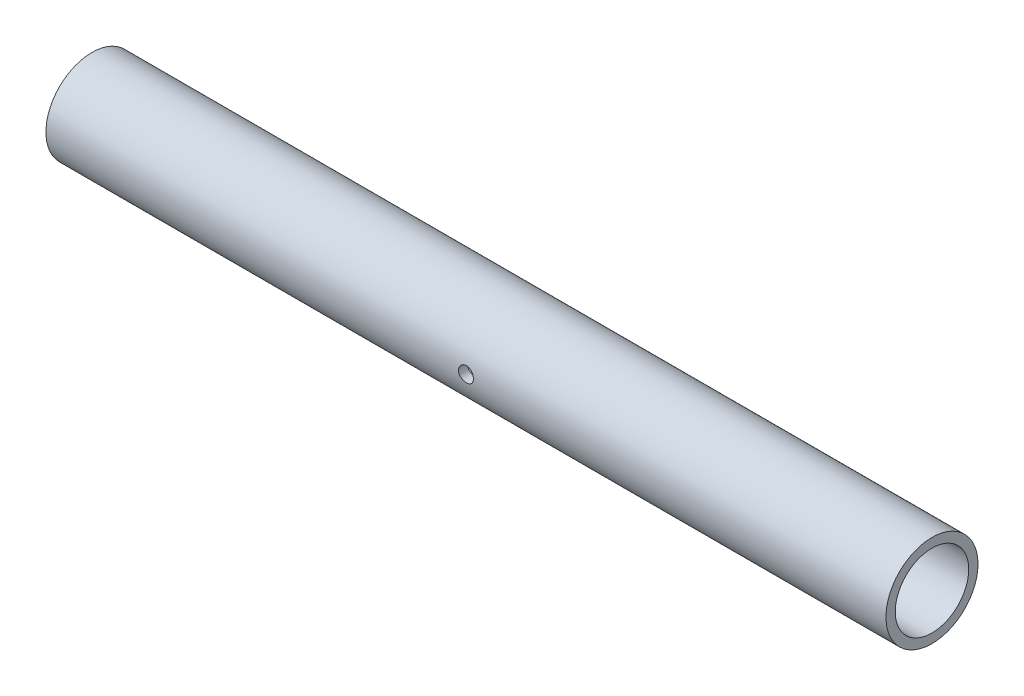
ISO-10303-21;
HEADER;
FILE_DESCRIPTION(('STEP AP214'),'2;1');
FILE_NAME('part.step','',(''),(''),'','','');
FILE_SCHEMA(('AUTOMOTIVE_DESIGN { 1 0 10303 214 1 1 1 1 }'));
ENDSEC;
DATA;
#1=APPLICATION_CONTEXT('core data for automotive mechanical design processes');
#2=APPLICATION_PROTOCOL_DEFINITION('international standard','automotive_design',2000,#1);
#3=PRODUCT_CONTEXT('',#1,'mechanical');
#4=PRODUCT('Part','Part','',(#3));
#5=PRODUCT_RELATED_PRODUCT_CATEGORY('part','',(#4));
#6=PRODUCT_DEFINITION_FORMATION('','',#4);
#7=PRODUCT_DEFINITION_CONTEXT('part definition',#1,'design');
#8=PRODUCT_DEFINITION('design','',#6,#7);
#9=PRODUCT_DEFINITION_SHAPE('','',#8);
#10=(LENGTH_UNIT() NAMED_UNIT(*) SI_UNIT(.MILLI.,.METRE.));
#11=(NAMED_UNIT(*) PLANE_ANGLE_UNIT() SI_UNIT($,.RADIAN.));
#12=(NAMED_UNIT(*) SI_UNIT($,.STERADIAN.) SOLID_ANGLE_UNIT());
#13=UNCERTAINTY_MEASURE_WITH_UNIT(LENGTH_MEASURE(1.E-05),#10,'distance_accuracy_value','');
#14=(GEOMETRIC_REPRESENTATION_CONTEXT(3) GLOBAL_UNCERTAINTY_ASSIGNED_CONTEXT((#13)) GLOBAL_UNIT_ASSIGNED_CONTEXT((#10,
#11,#12)) REPRESENTATION_CONTEXT('',''));
#15=CARTESIAN_POINT('',(0.,0.,0.));
#16=DIRECTION('',(0.,0.,1.));
#17=DIRECTION('',(1.,0.,0.));
#18=AXIS2_PLACEMENT_3D('',#15,#16,#17);
#19=CARTESIAN_POINT('',(304.8,0.,0.));
#20=DIRECTION('',(1.,0.,0.));
#21=DIRECTION('',(0.,0.,-1.));
#22=AXIS2_PLACEMENT_3D('',#19,#20,#21);
#23=PLANE('',#22);
#24=CARTESIAN_POINT('',(304.8,0.,0.));
#25=DIRECTION('',(1.,0.,0.));
#26=DIRECTION('',(0.,0.,-1.));
#27=AXIS2_PLACEMENT_3D('',#24,#25,#26);
#28=CIRCLE('',#27,16.7005);
#29=CARTESIAN_POINT('',(304.8,0.,-16.7005));
#30=VERTEX_POINT('',#29);
#31=EDGE_CURVE('E10',#30,#30,#28,.T.);
#32=ORIENTED_EDGE('',*,*,#31,.T.);
#33=EDGE_LOOP('',(#32));
#34=FACE_BOUND('',#33,.T.);
#35=CARTESIAN_POINT('',(304.8,0.,0.));
#36=DIRECTION('',(1.,0.,0.));
#37=DIRECTION('',(0.,0.,-1.));
#38=AXIS2_PLACEMENT_3D('',#35,#36,#37);
#39=CIRCLE('',#38,13.335);
#40=CARTESIAN_POINT('',(304.8,0.,-13.335));
#41=VERTEX_POINT('',#40);
#42=EDGE_CURVE('E44',#41,#41,#39,.T.);
#43=ORIENTED_EDGE('',*,*,#42,.F.);
#44=EDGE_LOOP('',(#43));
#45=FACE_BOUND('',#44,.T.);
#46=ADVANCED_FACE('F32',(#34,#45),#23,.T.);
#47=CARTESIAN_POINT('',(0.,0.,0.));
#48=DIRECTION('',(1.,0.,0.));
#49=DIRECTION('',(0.,0.,-1.));
#50=AXIS2_PLACEMENT_3D('',#47,#48,#49);
#51=PLANE('',#50);
#52=CARTESIAN_POINT('',(0.,0.,0.));
#53=DIRECTION('',(1.,0.,0.));
#54=DIRECTION('',(0.,0.,-1.));
#55=AXIS2_PLACEMENT_3D('',#52,#53,#54);
#56=CIRCLE('',#55,16.7005);
#57=CARTESIAN_POINT('',(0.,0.,-16.7005));
#58=VERTEX_POINT('',#57);
#59=EDGE_CURVE('E37',#58,#58,#56,.T.);
#60=ORIENTED_EDGE('',*,*,#59,.F.);
#61=EDGE_LOOP('',(#60));
#62=FACE_BOUND('',#61,.T.);
#63=CARTESIAN_POINT('',(0.,0.,0.));
#64=DIRECTION('',(1.,0.,0.));
#65=DIRECTION('',(0.,0.,-1.));
#66=AXIS2_PLACEMENT_3D('',#63,#64,#65);
#67=CIRCLE('',#66,13.335);
#68=CARTESIAN_POINT('',(0.,0.,-13.335));
#69=VERTEX_POINT('',#68);
#70=EDGE_CURVE('E46',#69,#69,#67,.T.);
#71=ORIENTED_EDGE('',*,*,#70,.T.);
#72=EDGE_LOOP('',(#71));
#73=FACE_BOUND('',#72,.T.);
#74=ADVANCED_FACE('F75',(#62,#73),#51,.F.);
#75=CARTESIAN_POINT('',(304.8,0.,0.));
#76=DIRECTION('',(-1.,0.,0.));
#77=DIRECTION('',(0.,0.,1.));
#78=AXIS2_PLACEMENT_3D('',#75,#76,#77);
#79=CYLINDRICAL_SURFACE('',#78,16.7005);
#80=CARTESIAN_POINT('',(155.1051,0.,16.7005));
#81=CARTESIAN_POINT('',(155.105093897087,-0.150888062548303,16.7004974577365));
#82=CARTESIAN_POINT('',(155.092432758379,-0.301859994666066,16.6984337641219));
#83=CARTESIAN_POINT('',(155.042141383676,-0.599573765303217,16.6903999723937));
#84=CARTESIAN_POINT('',(155.004487792628,-0.746311513080885,16.6844262204648));
#85=CARTESIAN_POINT('',(154.90537472287,-1.0312061766267,16.6692427211351));
#86=CARTESIAN_POINT('',(154.843934287842,-1.16936985436145,16.6600355629369));
#87=CARTESIAN_POINT('',(154.699040513581,-1.43340829062403,16.6393990707399));
#88=CARTESIAN_POINT('',(154.615589848481,-1.55928453946972,16.6279700067358));
#89=CARTESIAN_POINT('',(154.428240590823,-1.79633294529008,16.6040421740029));
#90=CARTESIAN_POINT('',(154.324181856033,-1.90737774983379,16.591535491026));
#91=CARTESIAN_POINT('',(154.098914989324,-2.1105114085896,16.5669229733114));
#92=CARTESIAN_POINT('',(153.977705804489,-2.20259909811607,16.5548171632407));
#93=CARTESIAN_POINT('',(153.720709403468,-2.36571066174806,16.5323003820462));
#94=CARTESIAN_POINT('',(153.58484178218,-2.43660938550688,16.521899638475));
#95=CARTESIAN_POINT('',(153.302929431016,-2.55453030416696,16.5040799174436));
#96=CARTESIAN_POINT('',(153.156885350204,-2.60155402025599,16.4966607500196));
#97=CARTESIAN_POINT('',(152.860112716242,-2.66999048982907,16.4857227198729));
#98=CARTESIAN_POINT('',(152.709435998324,-2.69162258951269,16.4821704723586));
#99=CARTESIAN_POINT('',(152.406552768084,-2.70934168919743,16.4792673895096));
#100=CARTESIAN_POINT('',(152.254346358719,-2.70543039707,16.4799162732805));
#101=CARTESIAN_POINT('',(151.954285356396,-2.67235257585698,16.4853116422221));
#102=CARTESIAN_POINT('',(151.806402847489,-2.64343183378623,16.4900182476923));
#103=CARTESIAN_POINT('',(151.517617291042,-2.56154150799834,16.502936357017));
#104=CARTESIAN_POINT('',(151.37671447089,-2.50857114134623,16.5111479749766));
#105=CARTESIAN_POINT('',(151.105148697648,-2.37983413536215,16.5301942305314));
#106=CARTESIAN_POINT('',(150.974535269656,-2.30396483733819,16.5410406365502));
#107=CARTESIAN_POINT('',(150.727800002518,-2.13165657059765,16.5641260861383));
#108=CARTESIAN_POINT('',(150.611679270523,-2.03521603188844,16.5763652359683));
#109=CARTESIAN_POINT('',(150.395802387933,-1.82316079178855,16.6010326457947));
#110=CARTESIAN_POINT('',(150.296253457762,-1.70733507940944,16.6134614436807));
#111=CARTESIAN_POINT('',(150.117973519348,-1.46051261763989,16.6369752748997));
#112=CARTESIAN_POINT('',(150.039242631801,-1.32951578029888,16.6480603004418));
#113=CARTESIAN_POINT('',(149.904817203808,-1.05587919110396,16.6676520858549));
#114=CARTESIAN_POINT('',(149.849140292661,-0.913230628642439,16.6761568713015));
#115=CARTESIAN_POINT('',(149.762592033457,-0.620439017931161,16.689613888894));
#116=CARTESIAN_POINT('',(149.731718726758,-0.470296562439258,16.6945664015455));
#117=CARTESIAN_POINT('',(149.695933402982,-0.16856590589134,16.7003233068798));
#118=CARTESIAN_POINT('',(149.690736794805,-0.0170122941565777,16.7011731693918));
#119=CARTESIAN_POINT('',(149.705694623299,0.284800682339517,16.6987533332108));
#120=CARTESIAN_POINT('',(149.725848140432,0.435060093846976,16.6954837839433));
#121=CARTESIAN_POINT('',(149.79069743882,0.729145269491143,16.6852206333956));
#122=CARTESIAN_POINT('',(149.835252978216,0.873002765566383,16.6782483193063));
#123=CARTESIAN_POINT('',(149.947492520573,1.15120604540566,16.6613584524574));
#124=CARTESIAN_POINT('',(150.015177761857,1.28555131943812,16.6514407420105));
#125=CARTESIAN_POINT('',(150.172411794106,1.54215720864201,16.629647987126));
#126=CARTESIAN_POINT('',(150.262139161391,1.66430704194941,16.6177572269374));
#127=CARTESIAN_POINT('',(150.460663902427,1.89191696449165,16.5933865628871));
#128=CARTESIAN_POINT('',(150.569462579924,1.99737591177163,16.5809066187905));
#129=CARTESIAN_POINT('',(150.804315231753,2.18965975513515,16.5566179523259));
#130=CARTESIAN_POINT('',(150.93052720777,2.27629280016818,16.5448169671038));
#131=CARTESIAN_POINT('',(151.195879626388,2.42712761732702,16.5233646792845));
#132=CARTESIAN_POINT('',(151.335019675855,2.49133007126879,16.5137133113492));
#133=CARTESIAN_POINT('',(151.62173175804,2.59519124980596,16.4977104952734));
#134=CARTESIAN_POINT('',(151.769267861794,2.6349470586088,16.4913460103877));
#135=CARTESIAN_POINT('',(152.069034939324,2.68909299931143,16.4826042915982));
#136=CARTESIAN_POINT('',(152.221265528669,2.70348520265564,16.4802267320832));
#137=CARTESIAN_POINT('',(152.524185617428,2.70644008511556,16.4797415544371));
#138=CARTESIAN_POINT('',(152.674872177798,2.69530464320214,16.4815840317318));
#139=CARTESIAN_POINT('',(152.972198053532,2.64817138492831,16.4892222214147));
#140=CARTESIAN_POINT('',(153.118837379963,2.61217363655834,16.4950179229922));
#141=CARTESIAN_POINT('',(153.403799112764,2.51645069874717,16.5098910068696));
#142=CARTESIAN_POINT('',(153.542129961818,2.45675008128221,16.5189649898099));
#143=CARTESIAN_POINT('',(153.806861126234,2.31534678208125,16.5393757512933));
#144=CARTESIAN_POINT('',(153.933260903651,2.23364310891717,16.5507126317935));
#145=CARTESIAN_POINT('',(154.172069631771,2.0494698849786,16.5745306822589));
#146=CARTESIAN_POINT('',(154.284305840065,1.94677779193518,16.5870232561983));
#147=CARTESIAN_POINT('',(154.490057277457,1.72401256578686,16.6116529092408));
#148=CARTESIAN_POINT('',(154.583568172536,1.60393541992531,16.6237899054911));
#149=CARTESIAN_POINT('',(154.749765732965,1.34888505958874,16.6464318057398));
#150=CARTESIAN_POINT('',(154.822313353884,1.21382025362174,16.6569256097812));
#151=CARTESIAN_POINT('',(154.943580335504,0.933308987477759,16.6749905845962));
#152=CARTESIAN_POINT('',(154.992323705429,0.787873158058099,16.6825646985689));
#153=CARTESIAN_POINT('',(155.053878589069,0.534871671086589,16.6922617563775));
#154=CARTESIAN_POINT('',(155.073056270392,0.428846028496355,16.6953347747841));
#155=CARTESIAN_POINT('',(155.098669052378,0.215227800139453,16.6994547874161));
#156=CARTESIAN_POINT('',(155.105104353482,0.107635239047601,16.7005018135109));
#157=CARTESIAN_POINT('',(155.1051,0.,16.7005));
#158=B_SPLINE_CURVE_WITH_KNOTS('',3,(#80,#81,#82,#83,#84,#85,#86,#87,#88,#89,#90,#91,#92,#93,
#94,#95,#96,#97,#98,#99,#100,#101,#102,#103,#104,#105,#106,#107,#108,#109,#110,#111,#112,#113,
#114,#115,#116,#117,#118,#119,#120,#121,#122,#123,#124,#125,#126,#127,#128,#129,#130,#131,#132,
#133,#134,#135,#136,#137,#138,#139,#140,#141,#142,#143,#144,#145,#146,#147,#148,#149,#150,#151,
#152,#153,#154,#155,#156,#157),.UNSPECIFIED.,.T.,.F.,(4,2,2,2,2,2,2,2,2,2,2,2,2,2,2,2,2,2,2,2,2,
2,2,2,2,2,2,2,2,2,2,2,2,2,2,2,2,2,4),(0.,0.452270787216408,0.904964810512096,1.35729715518357,
1.80957456901735,2.26551517452944,2.72148378372722,3.18009458772586,3.63867616782943,
4.09326642255645,4.54782628297365,4.9979689596137,5.44812629168908,5.90033249063431,
6.35257321421474,6.81010181368963,7.26763306569815,7.7255135470429,8.18335786781695,
8.63611604666351,9.08885780285638,9.53902448404456,9.98921527009213,10.4431811075173,
10.8971779909038,11.3556045004122,11.8140170740548,12.2705972081985,12.7271400517363,
13.1783119065942,13.6294825276468,14.0801866512621,14.5309110863978,14.9866887137601,
15.4425717103213,15.9014124875041,16.3597895122137,16.6824196742317,17.0050447611613),.UNSPECIFIED.);
#159=CARTESIAN_POINT('',(155.1051,0.,16.7005));
#160=VERTEX_POINT('',#159);
#161=EDGE_CURVE('E49',#160,#160,#158,.T.);
#162=ORIENTED_EDGE('',*,*,#161,.T.);
#163=EDGE_LOOP('',(#162));
#164=FACE_BOUND('',#163,.T.);
#165=ORIENTED_EDGE('',*,*,#31,.F.);
#166=EDGE_LOOP('',(#165));
#167=FACE_BOUND('',#166,.T.);
#168=ORIENTED_EDGE('',*,*,#59,.T.);
#169=EDGE_LOOP('',(#168));
#170=FACE_BOUND('',#169,.T.);
#171=ADVANCED_FACE('F34',(#164,#167,#170),#79,.T.);
#172=CARTESIAN_POINT('',(304.8,0.,0.));
#173=DIRECTION('',(-1.,0.,0.));
#174=DIRECTION('',(0.,0.,1.));
#175=AXIS2_PLACEMENT_3D('',#172,#173,#174);
#176=CYLINDRICAL_SURFACE('',#175,13.335);
#177=CARTESIAN_POINT('',(155.1051,0.,13.335));
#178=CARTESIAN_POINT('',(155.105094525376,-0.150295600484553,13.3349972242289));
#179=CARTESIAN_POINT('',(155.092532026992,-0.300659946654723,13.3324330403292));
#180=CARTESIAN_POINT('',(155.0426556573,-0.597135385188636,13.3224513830455));
#181=CARTESIAN_POINT('',(155.00532241314,-0.743243055026255,13.3150301110628));
#182=CARTESIAN_POINT('',(154.907107787482,-1.02687601225216,13.296162618508));
#183=CARTESIAN_POINT('',(154.84624926408,-1.16440948049959,13.2847203059164));
#184=CARTESIAN_POINT('',(154.702780252209,-1.4273047577558,13.2590533011895));
#185=CARTESIAN_POINT('',(154.620170950095,-1.55266723009767,13.2448287608163));
#186=CARTESIAN_POINT('',(154.434327195231,-1.7894149071107,13.2149405065597));
#187=CARTESIAN_POINT('',(154.330848481905,-1.9006064034824,13.199261063324));
#188=CARTESIAN_POINT('',(154.106728265231,-2.10417816613857,13.168344071895));
#189=CARTESIAN_POINT('',(153.986085396097,-2.19655693403454,13.1531065589832));
#190=CARTESIAN_POINT('',(153.729662382321,-2.36070988620932,13.1246448707219));
#191=CARTESIAN_POINT('',(153.593750860226,-2.43228266379821,13.1114409219455));
#192=CARTESIAN_POINT('',(153.311518766293,-2.55150142471515,13.0887651113974));
#193=CARTESIAN_POINT('',(153.165199255873,-2.59914984389556,13.0792928697041));
#194=CARTESIAN_POINT('',(152.868391357684,-2.6685367944566,13.0653122596412));
#195=CARTESIAN_POINT('',(152.717985662028,-2.69061565322798,13.0607387529412));
#196=CARTESIAN_POINT('',(152.415540625344,-2.70929399940926,13.0568774442569));
#197=CARTESIAN_POINT('',(152.263501457958,-2.70589616880503,13.0575890858936));
#198=CARTESIAN_POINT('',(151.964601070229,-2.67399255726,13.0641585153922));
#199=CARTESIAN_POINT('',(151.817696102583,-2.64587767366682,13.0699361809375));
#200=CARTESIAN_POINT('',(151.530732268451,-2.56595538643003,13.0858604269536));
#201=CARTESIAN_POINT('',(151.390673737762,-2.51414682197339,13.0960072214775));
#202=CARTESIAN_POINT('',(151.120256078371,-2.38793669722346,13.1196079166759));
#203=CARTESIAN_POINT('',(150.989970984035,-2.31338088418128,13.1330842731062));
#204=CARTESIAN_POINT('',(150.74361439873,-2.14390140848478,13.1618113260375));
#205=CARTESIAN_POINT('',(150.627544588842,-2.04897534051733,13.1770622319794));
#206=CARTESIAN_POINT('',(150.410658529072,-1.83936052489874,13.207966610656));
#207=CARTESIAN_POINT('',(150.310164588826,-1.72433832876226,13.2236223079897));
#208=CARTESIAN_POINT('',(150.129845547073,-1.47890259644831,13.2533138361505));
#209=CARTESIAN_POINT('',(150.050020725472,-1.34848885186894,13.2673496450393));
#210=CARTESIAN_POINT('',(149.913243309945,-1.07560877370192,13.2922559746792));
#211=CARTESIAN_POINT('',(149.856328351573,-0.9331230696536,13.3031212790442));
#212=CARTESIAN_POINT('',(149.767334173484,-0.640342655170266,13.3204229182029));
#213=CARTESIAN_POINT('',(149.735251857011,-0.490048920930976,13.3268598052313));
#214=CARTESIAN_POINT('',(149.697291809661,-0.188687712334038,13.3345021896925));
#215=CARTESIAN_POINT('',(149.69097311446,-0.037677946869132,13.3357957101814));
#216=CARTESIAN_POINT('',(149.703530978531,0.263239556156422,13.3332504287549));
#217=CARTESIAN_POINT('',(149.722406078805,0.413147357027401,13.32941192404));
#218=CARTESIAN_POINT('',(149.784449478553,0.706177355722136,13.3170890419464));
#219=CARTESIAN_POINT('',(149.827390777664,0.849349603396196,13.3086480961947));
#220=CARTESIAN_POINT('',(149.936098999973,1.12646132397948,13.2880635649464));
#221=CARTESIAN_POINT('',(150.001867669613,1.26040008952707,13.2759196961607));
#222=CARTESIAN_POINT('',(150.1553124641,1.51709720534946,13.249057435921));
#223=CARTESIAN_POINT('',(150.243253128819,1.63969417441024,13.234308651375));
#224=CARTESIAN_POINT('',(150.438192261469,1.86854925612131,13.2039425775509));
#225=CARTESIAN_POINT('',(150.545192835727,1.97480556053181,13.1883251924146));
#226=CARTESIAN_POINT('',(150.777224325758,2.16967113581846,13.1576842969314));
#227=CARTESIAN_POINT('',(150.902511858808,2.2579772780275,13.1426739537023));
#228=CARTESIAN_POINT('',(151.166400440108,2.41229295069217,13.1152291615274));
#229=CARTESIAN_POINT('',(151.305000947602,2.47830338628301,13.1027946080206));
#230=CARTESIAN_POINT('',(151.590874470357,2.58574384042946,13.0820163622959));
#231=CARTESIAN_POINT('',(151.738097250659,2.62730316903986,13.0736511905723));
#232=CARTESIAN_POINT('',(152.037624714809,2.68505210426675,13.0619142618958));
#233=CARTESIAN_POINT('',(152.189928711529,2.70124512705367,13.058541832556));
#234=CARTESIAN_POINT('',(152.492249983923,2.70767252503984,13.0572103103202));
#235=CARTESIAN_POINT('',(152.642256835453,2.69838611838186,13.0591512812084));
#236=CARTESIAN_POINT('',(152.938522306478,2.65517792546284,13.0680041721845));
#237=CARTESIAN_POINT('',(153.084780958013,2.62125634986901,13.0749160497637));
#238=CARTESIAN_POINT('',(153.369082210092,2.52995717578002,13.0928866727968));
#239=CARTESIAN_POINT('',(153.507144922099,2.47263996377305,13.1039347363055));
#240=CARTESIAN_POINT('',(153.771768617197,2.33623222267459,13.1289386922158));
#241=CARTESIAN_POINT('',(153.898328599311,2.25713980109381,13.1428948373339));
#242=CARTESIAN_POINT('',(154.138737028366,2.07779697949024,13.1724471666242));
#243=CARTESIAN_POINT('',(154.252324843556,1.97720115843756,13.188067738479));
#244=CARTESIAN_POINT('',(154.461166037052,1.75841835754841,13.2190155313656));
#245=CARTESIAN_POINT('',(154.556415194048,1.64022733861366,13.2343426841269));
#246=CARTESIAN_POINT('',(154.726850865077,1.38807123157175,13.2631724688158));
#247=CARTESIAN_POINT('',(154.801809092012,1.25394927014427,13.276653559364));
#248=CARTESIAN_POINT('',(154.928003538366,0.974774923026418,13.3000597177516));
#249=CARTESIAN_POINT('',(154.97926092306,0.829732424717033,13.3099879565525));
#250=CARTESIAN_POINT('',(155.046787117943,0.570324604330927,13.3232639467522));
#251=CARTESIAN_POINT('',(155.068615067119,0.45742586083621,13.327638992893));
#252=CARTESIAN_POINT('',(155.097773357139,0.22969808726299,13.3335080319502));
#253=CARTESIAN_POINT('',(155.10510418419,0.114869122050805,13.3350021214885));
#254=CARTESIAN_POINT('',(155.1051,0.,13.335));
#255=B_SPLINE_CURVE_WITH_KNOTS('',3,(#177,#178,#179,#180,#181,#182,#183,#184,#185,#186,#187,
#188,#189,#190,#191,#192,#193,#194,#195,#196,#197,#198,#199,#200,#201,#202,#203,#204,#205,#206,
#207,#208,#209,#210,#211,#212,#213,#214,#215,#216,#217,#218,#219,#220,#221,#222,#223,#224,#225,
#226,#227,#228,#229,#230,#231,#232,#233,#234,#235,#236,#237,#238,#239,#240,#241,#242,#243,#244,
#245,#246,#247,#248,#249,#250,#251,#252,#253,#254),.UNSPECIFIED.,.T.,.F.,(4,2,2,2,2,2,2,2,2,2,2,
2,2,2,2,2,2,2,2,2,2,2,2,2,2,2,2,2,2,2,2,2,2,2,2,2,2,2,4),(0.,0.450466540959125,
0.901285801401294,1.35166812455106,1.80202588755751,2.25799744724725,2.71400530978153,
3.17429068540293,3.63452918768033,4.0885689020244,4.54256081930287,4.98949951624589,
5.43646011218639,5.88652164703375,6.33663635427288,6.79508725203935,7.25354435795345,
7.71275155793441,8.1719014832478,8.62315884642445,9.07439007798768,9.52143509257741,
9.96851431656822,10.4212035028349,10.8739427471937,11.3337873895974,11.7936133615181,
12.2509851539842,12.7082953452709,13.1570636849492,13.6058281870383,14.0534416345438,
14.501093996541,14.9565651472641,15.4121410161987,15.8726474155708,16.3327417764777,
16.677039489884,17.0213256559887),.UNSPECIFIED.);
#256=CARTESIAN_POINT('',(155.1051,0.,13.335));
#257=VERTEX_POINT('',#256);
#258=EDGE_CURVE('E58',#257,#257,#255,.T.);
#259=ORIENTED_EDGE('',*,*,#258,.F.);
#260=EDGE_LOOP('',(#259));
#261=FACE_BOUND('',#260,.T.);
#262=ORIENTED_EDGE('',*,*,#42,.T.);
#263=EDGE_LOOP('',(#262));
#264=FACE_BOUND('',#263,.T.);
#265=ORIENTED_EDGE('',*,*,#70,.F.);
#266=EDGE_LOOP('',(#265));
#267=FACE_BOUND('',#266,.T.);
#268=ADVANCED_FACE('F66',(#261,#264,#267),#176,.F.);
#269=CARTESIAN_POINT('',(152.4,0.,16.7005));
#270=DIRECTION('',(0.,0.,1.));
#271=DIRECTION('',(1.,0.,0.));
#272=AXIS2_PLACEMENT_3D('',#269,#270,#271);
#273=CYLINDRICAL_SURFACE('',#272,2.70509999999999);
#274=ORIENTED_EDGE('',*,*,#258,.T.);
#275=EDGE_LOOP('',(#274));
#276=FACE_BOUND('',#275,.T.);
#277=ORIENTED_EDGE('',*,*,#161,.F.);
#278=EDGE_LOOP('',(#277));
#279=FACE_BOUND('',#278,.T.);
#280=ADVANCED_FACE('F63',(#276,#279),#273,.F.);
#281=CLOSED_SHELL('',(#46,#74,#171,#268,#280));
#282=MANIFOLD_SOLID_BREP('B2',#281);
#283=ADVANCED_BREP_SHAPE_REPRESENTATION('',(#18,#282),#14);
#284=SHAPE_DEFINITION_REPRESENTATION(#9,#283);
ENDSEC;
END-ISO-10303-21;
